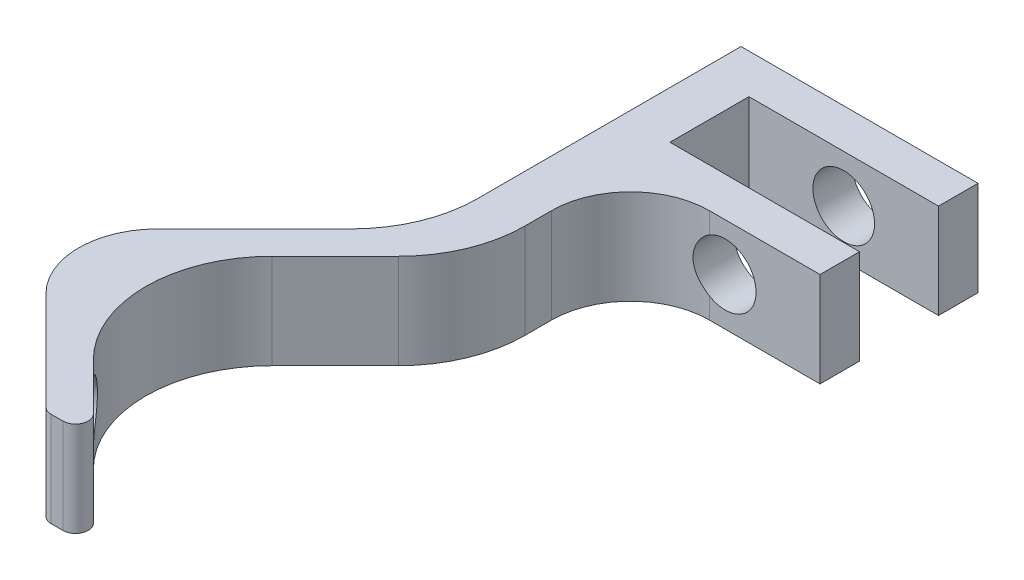
ISO-10303-21;
HEADER;
FILE_DESCRIPTION(('STEP AP214'),'2;1');
FILE_NAME('part.step','',(''),(''),'','','');
FILE_SCHEMA(('AUTOMOTIVE_DESIGN { 1 0 10303 214 1 1 1 1 }'));
ENDSEC;
DATA;
#1=APPLICATION_CONTEXT('core data for automotive mechanical design processes');
#2=APPLICATION_PROTOCOL_DEFINITION('international standard','automotive_design',2000,#1);
#3=PRODUCT_CONTEXT('',#1,'mechanical');
#4=PRODUCT('Part','Part','',(#3));
#5=PRODUCT_RELATED_PRODUCT_CATEGORY('part','',(#4));
#6=PRODUCT_DEFINITION_FORMATION('','',#4);
#7=PRODUCT_DEFINITION_CONTEXT('part definition',#1,'design');
#8=PRODUCT_DEFINITION('design','',#6,#7);
#9=PRODUCT_DEFINITION_SHAPE('','',#8);
#10=(LENGTH_UNIT() NAMED_UNIT(*) SI_UNIT(.MILLI.,.METRE.));
#11=(NAMED_UNIT(*) PLANE_ANGLE_UNIT() SI_UNIT($,.RADIAN.));
#12=(NAMED_UNIT(*) SI_UNIT($,.STERADIAN.) SOLID_ANGLE_UNIT());
#13=UNCERTAINTY_MEASURE_WITH_UNIT(LENGTH_MEASURE(1.E-05),#10,'distance_accuracy_value','');
#14=(GEOMETRIC_REPRESENTATION_CONTEXT(3) GLOBAL_UNCERTAINTY_ASSIGNED_CONTEXT((#13)) GLOBAL_UNIT_ASSIGNED_CONTEXT((#10,
#11,#12)) REPRESENTATION_CONTEXT('',''));
#15=CARTESIAN_POINT('',(0.,0.,0.));
#16=DIRECTION('',(0.,0.,1.));
#17=DIRECTION('',(1.,0.,0.));
#18=AXIS2_PLACEMENT_3D('',#15,#16,#17);
#19=CARTESIAN_POINT('',(2.31370849898492,6.,11.9999999999999));
#20=DIRECTION('',(0.,1.,0.));
#21=DIRECTION('',(0.,0.,1.));
#22=AXIS2_PLACEMENT_3D('',#19,#20,#21);
#23=CYLINDRICAL_SURFACE('',#22,8.);
#24=CARTESIAN_POINT('',(-3.34314575050741,1.11172612947398,17.6568542494924));
#25=CARTESIAN_POINT('',(-3.38026868633156,1.11758526246244,17.6197352850169));
#26=CARTESIAN_POINT('',(-3.41683027289528,1.12563296642928,17.5824381308588));
#27=CARTESIAN_POINT('',(-3.48863525563479,1.1460382770672,17.507765682977));
#28=CARTESIAN_POINT('',(-3.52387886168609,1.15839519427455,17.4703904027037));
#29=CARTESIAN_POINT('',(-3.62718020571579,1.2017585388184,17.3587378902489));
#30=CARTESIAN_POINT('',(-3.69300080004003,1.23908834308023,17.2847408116208));
#31=CARTESIAN_POINT('',(-3.8171330718599,1.32945350983912,17.1402224438868));
#32=CARTESIAN_POINT('',(-3.87544506117879,1.38248821982848,17.0697010105168));
#33=CARTESIAN_POINT('',(-3.98370965686038,1.50276665976273,16.9345744177806));
#34=CARTESIAN_POINT('',(-4.03366074129167,1.57001297160887,16.8699703365141));
#35=CARTESIAN_POINT('',(-4.12531984934452,1.71805560649986,16.7481395890465));
#36=CARTESIAN_POINT('',(-4.16688623946183,1.79904797842029,16.6910445814565));
#37=CARTESIAN_POINT('',(-4.24042213781519,1.97165862140514,16.5877449082642));
#38=CARTESIAN_POINT('',(-4.27239058310512,2.06327806783246,16.5415414489927));
#39=CARTESIAN_POINT('',(-4.32666619054601,2.25523302013596,16.4618130253665));
#40=CARTESIAN_POINT('',(-4.34891563127374,2.35561646243348,16.4283639548239));
#41=CARTESIAN_POINT('',(-4.38333734596562,2.56177592608797,16.3761359280304));
#42=CARTESIAN_POINT('',(-4.39551151144071,2.66755093128403,16.3573542181974));
#43=CARTESIAN_POINT('',(-4.40958235520566,2.8793772401308,16.3356114356775));
#44=CARTESIAN_POINT('',(-4.41166685351984,2.98538643669897,16.3323612569368));
#45=CARTESIAN_POINT('',(-4.40605536689188,3.19651347740194,16.3410597195594));
#46=CARTESIAN_POINT('',(-4.39835991880231,3.3016313701444,16.3530075266566));
#47=CARTESIAN_POINT('',(-4.37337216450155,3.50682541552482,16.3912937117799));
#48=CARTESIAN_POINT('',(-4.35618473358038,3.60694385201099,16.4174747804725));
#49=CARTESIAN_POINT('',(-4.31238360338175,3.80063489942152,16.4829057726309));
#50=CARTESIAN_POINT('',(-4.28576878666177,3.89420673279176,16.5221572453186));
#51=CARTESIAN_POINT('',(-4.22278762552673,4.07373662366312,16.6127320785239));
#52=CARTESIAN_POINT('',(-4.18627663084817,4.15955430973277,16.6642329964151));
#53=CARTESIAN_POINT('',(-4.10396524697651,4.31966549521458,16.7768521724449));
#54=CARTESIAN_POINT('',(-4.05816355477987,4.39395737557119,16.8379717793174));
#55=CARTESIAN_POINT('',(-3.9569262236325,4.5301046326261,16.9685068854595));
#56=CARTESIAN_POINT('',(-3.90134813873787,4.5917419557098,17.0380394941433));
#57=CARTESIAN_POINT('',(-3.78187485749184,4.69924455389021,17.1819479334774));
#58=CARTESIAN_POINT('',(-3.7179848770027,4.74511965487436,17.2563207123291));
#59=CARTESIAN_POINT('',(-3.60250627958484,4.80899428700221,17.3854993437981));
#60=CARTESIAN_POINT('',(-3.55264356938268,4.83121502751205,17.4398007323498));
#61=CARTESIAN_POINT('',(-3.4499670508317,4.86659987206433,17.548486555556));
#62=CARTESIAN_POINT('',(-3.39715529998864,4.8797702071596,17.602870907186));
#63=CARTESIAN_POINT('',(-3.34314575050741,4.88827387052602,17.6568542494924));
#64=B_SPLINE_CURVE_WITH_KNOTS('',3,(#24,#25,#26,#27,#28,#29,#30,#31,#32,#33,#34,#35,#36,#37,#38,
#39,#40,#41,#42,#43,#44,#45,#46,#47,#48,#49,#50,#51,#52,#53,#54,#55,#56,#57,#58,#59,#60,#61,#62,
#63),.UNSPECIFIED.,.F.,.F.,(4,2,2,2,2,2,2,2,2,2,2,2,2,2,2,2,2,2,2,4),(0.,0.158368251928382,
0.316711176934528,0.632584748658386,0.948445198302263,1.26436308148817,1.58523781663443,
1.90614807468226,2.22893913929065,2.55166959002935,2.86836865480728,3.18505033571081,
3.49830109793384,3.81158900268269,4.12972921281349,4.44791407242166,4.77119098163774,
5.09426599861504,5.32470014190911,5.55497547576771),.UNSPECIFIED.);
#65=CARTESIAN_POINT('',(-3.34314575050741,1.11172612947398,17.6568542494924));
#66=VERTEX_POINT('',#65);
#67=CARTESIAN_POINT('',(-3.34314575050741,4.88827387052602,17.6568542494924));
#68=VERTEX_POINT('',#67);
#69=EDGE_CURVE('E212',#66,#68,#64,.T.);
#70=ORIENTED_EDGE('',*,*,#69,.F.);
#71=DIRECTION('',(0.,-1.,0.));
#72=VECTOR('',#71,1.);
#73=CARTESIAN_POINT('',(-3.34314575050741,6.,17.6568542494924));
#74=LINE('',#73,#72);
#75=CARTESIAN_POINT('',(-3.34314575050741,0.,17.6568542494924));
#76=VERTEX_POINT('',#75);
#77=EDGE_CURVE('E319',#76,#66,#74,.F.);
#78=ORIENTED_EDGE('',*,*,#77,.F.);
#79=CARTESIAN_POINT('',(2.31370849898492,0.,11.9999999999999));
#80=DIRECTION('',(0.,1.,0.));
#81=DIRECTION('',(0.,0.,1.));
#82=AXIS2_PLACEMENT_3D('',#79,#80,#81);
#83=CIRCLE('',#82,8.);
#84=CARTESIAN_POINT('',(-3.34314575050749,0.,6.34314575050757));
#85=VERTEX_POINT('',#84);
#86=EDGE_CURVE('E322',#85,#76,#83,.T.);
#87=ORIENTED_EDGE('',*,*,#86,.F.);
#88=DIRECTION('',(0.,-1.,0.));
#89=VECTOR('',#88,1.);
#90=CARTESIAN_POINT('',(-3.34314575050749,0.,6.34314575050757));
#91=LINE('',#90,#89);
#92=CARTESIAN_POINT('',(-3.34314575050749,6.,6.34314575050757));
#93=VERTEX_POINT('',#92);
#94=EDGE_CURVE('E315',#93,#85,#91,.T.);
#95=ORIENTED_EDGE('',*,*,#94,.F.);
#96=CARTESIAN_POINT('',(2.31370849898492,6.,11.9999999999999));
#97=DIRECTION('',(0.,1.,0.));
#98=DIRECTION('',(0.,0.,1.));
#99=AXIS2_PLACEMENT_3D('',#96,#97,#98);
#100=CIRCLE('',#99,8.);
#101=CARTESIAN_POINT('',(-3.34314575050741,6.,17.6568542494924));
#102=VERTEX_POINT('',#101);
#103=EDGE_CURVE('E325',#102,#93,#100,.F.);
#104=ORIENTED_EDGE('',*,*,#103,.F.);
#105=EDGE_CURVE('E318',#68,#102,#74,.F.);
#106=ORIENTED_EDGE('',*,*,#105,.F.);
#107=EDGE_LOOP('',(#70,#78,#87,#95,#104,#106));
#108=FACE_BOUND('',#107,.T.);
#109=ADVANCED_FACE('F39',(#108),#23,.F.);
#110=CARTESIAN_POINT('',(0.,6.,0.));
#111=DIRECTION('',(0.707106781186551,0.,0.707106781186544));
#112=DIRECTION('',(0.707106781186544,0.,-0.707106781186551));
#113=AXIS2_PLACEMENT_3D('',#110,#111,#112);
#114=PLANE('',#113);
#115=DIRECTION('',(-0.707106781186544,0.,0.707106781186551));
#116=VECTOR('',#115,1.);
#117=CARTESIAN_POINT('',(0.,6.,0.));
#118=LINE('',#117,#116);
#119=CARTESIAN_POINT('',(-2.34314575050759,6.,2.34314575050762));
#120=VERTEX_POINT('',#119);
#121=CARTESIAN_POINT('',(-8.46446609406714,6.,8.46446609406723));
#122=VERTEX_POINT('',#121);
#123=EDGE_CURVE('E301',#120,#122,#118,.T.);
#124=ORIENTED_EDGE('',*,*,#123,.F.);
#125=DIRECTION('',(0.,-1.,0.));
#126=VECTOR('',#125,1.);
#127=CARTESIAN_POINT('',(-2.34314575050759,6.,2.34314575050762));
#128=LINE('',#127,#126);
#129=CARTESIAN_POINT('',(-2.34314575050759,0.,2.34314575050762));
#130=VERTEX_POINT('',#129);
#131=EDGE_CURVE('E338',#120,#130,#128,.T.);
#132=ORIENTED_EDGE('',*,*,#131,.T.);
#133=DIRECTION('',(-0.707106781186544,0.,0.707106781186551));
#134=VECTOR('',#133,1.);
#135=CARTESIAN_POINT('',(0.,0.,0.));
#136=LINE('',#135,#134);
#137=CARTESIAN_POINT('',(-8.46446609406714,0.,8.46446609406723));
#138=VERTEX_POINT('',#137);
#139=EDGE_CURVE('E263',#130,#138,#136,.T.);
#140=ORIENTED_EDGE('',*,*,#139,.T.);
#141=DIRECTION('',(0.,-1.,0.));
#142=VECTOR('',#141,1.);
#143=CARTESIAN_POINT('',(-8.46446609406714,6.,8.46446609406723));
#144=LINE('',#143,#142);
#145=EDGE_CURVE('E333',#138,#122,#144,.F.);
#146=ORIENTED_EDGE('',*,*,#145,.T.);
#147=EDGE_LOOP('',(#124,#132,#140,#146));
#148=FACE_BOUND('',#147,.T.);
#149=ADVANCED_FACE('F441',(#148),#114,.F.);
#150=CARTESIAN_POINT('',(-11.9999999999998,6.,12.));
#151=DIRECTION('',(0.707106781186541,0.,-0.707106781186554));
#152=DIRECTION('',(-0.707106781186554,0.,-0.707106781186541));
#153=AXIS2_PLACEMENT_3D('',#150,#151,#152);
#154=PLANE('',#153);
#155=CARTESIAN_POINT('',(-4.69411254969515,3.,19.3058874503046));
#156=DIRECTION('',(0.707106781186541,0.,-0.707106781186554));
#157=DIRECTION('',(-0.707106781186554,0.,-0.707106781186541));
#158=AXIS2_PLACEMENT_3D('',#155,#156,#157);
#159=CIRCLE('',#158,1.9);
#160=CARTESIAN_POINT('',(-6.0376154339496,3.,17.9623845660502));
#161=VERTEX_POINT('',#160);
#162=EDGE_CURVE('E266',#161,#161,#159,.F.);
#163=ORIENTED_EDGE('',*,*,#162,.F.);
#164=EDGE_LOOP('',(#163));
#165=FACE_BOUND('',#164,.T.);
#166=DIRECTION('',(0.707106781186554,0.,0.707106781186541));
#167=VECTOR('',#166,1.);
#168=CARTESIAN_POINT('',(-11.9999999999998,0.,12.));
#169=LINE('',#168,#167);
#170=CARTESIAN_POINT('',(-8.46446609406709,0.,15.5355339059327));
#171=VERTEX_POINT('',#170);
#172=CARTESIAN_POINT('',(-2.23431457505044,0.,21.7656854249492));
#173=VERTEX_POINT('',#172);
#174=EDGE_CURVE('E265',#171,#173,#169,.T.);
#175=ORIENTED_EDGE('',*,*,#174,.T.);
#176=DIRECTION('',(0.,-1.,0.));
#177=VECTOR('',#176,1.);
#178=CARTESIAN_POINT('',(-2.23431457505045,6.,21.7656854249492));
#179=LINE('',#178,#177);
#180=CARTESIAN_POINT('',(-2.23431457505044,6.,21.7656854249492));
#181=VERTEX_POINT('',#180);
#182=EDGE_CURVE('E365',#173,#181,#179,.F.);
#183=ORIENTED_EDGE('',*,*,#182,.T.);
#184=DIRECTION('',(0.707106781186554,0.,0.707106781186541));
#185=VECTOR('',#184,1.);
#186=CARTESIAN_POINT('',(-11.9999999999998,6.,12.));
#187=LINE('',#186,#185);
#188=CARTESIAN_POINT('',(-8.46446609406709,6.,15.5355339059327));
#189=VERTEX_POINT('',#188);
#190=EDGE_CURVE('E405',#189,#181,#187,.T.);
#191=ORIENTED_EDGE('',*,*,#190,.F.);
#192=DIRECTION('',(0.,-1.,0.));
#193=VECTOR('',#192,1.);
#194=CARTESIAN_POINT('',(-8.46446609406709,6.,15.5355339059327));
#195=LINE('',#194,#193);
#196=EDGE_CURVE('E327',#189,#171,#195,.T.);
#197=ORIENTED_EDGE('',*,*,#196,.T.);
#198=EDGE_LOOP('',(#175,#183,#191,#197));
#199=FACE_BOUND('',#198,.T.);
#200=ADVANCED_FACE('F451',(#165,#199),#154,.F.);
#201=CARTESIAN_POINT('',(0.,6.,22.));
#202=DIRECTION('',(0.,0.,-1.));
#203=DIRECTION('',(-1.,0.,0.));
#204=AXIS2_PLACEMENT_3D('',#201,#202,#203);
#205=PLANE('',#204);
#206=DIRECTION('',(1.,0.,0.));
#207=VECTOR('',#206,1.);
#208=CARTESIAN_POINT('',(0.,6.,22.));
#209=LINE('',#208,#207);
#210=CARTESIAN_POINT('',(-1.66862915010121,6.,22.));
#211=VERTEX_POINT('',#210);
#212=CARTESIAN_POINT('',(-0.93137084989818,6.,22.));
#213=VERTEX_POINT('',#212);
#214=EDGE_CURVE('E400',#211,#213,#209,.T.);
#215=ORIENTED_EDGE('',*,*,#214,.F.);
#216=DIRECTION('',(0.,-1.,0.));
#217=VECTOR('',#216,1.);
#218=CARTESIAN_POINT('',(-1.66862915010121,6.,22.));
#219=LINE('',#218,#217);
#220=CARTESIAN_POINT('',(-1.66862915010121,0.,22.));
#221=VERTEX_POINT('',#220);
#222=EDGE_CURVE('E358',#211,#221,#219,.T.);
#223=ORIENTED_EDGE('',*,*,#222,.T.);
#224=DIRECTION('',(1.,0.,0.));
#225=VECTOR('',#224,1.);
#226=CARTESIAN_POINT('',(0.,0.,22.));
#227=LINE('',#226,#225);
#228=CARTESIAN_POINT('',(-0.93137084989818,0.,22.));
#229=VERTEX_POINT('',#228);
#230=EDGE_CURVE('E269',#221,#229,#227,.T.);
#231=ORIENTED_EDGE('',*,*,#230,.T.);
#232=DIRECTION('',(0.,-1.,0.));
#233=VECTOR('',#232,1.);
#234=CARTESIAN_POINT('',(-0.93137084989818,6.,22.));
#235=LINE('',#234,#233);
#236=EDGE_CURVE('E356',#229,#213,#235,.F.);
#237=ORIENTED_EDGE('',*,*,#236,.T.);
#238=EDGE_LOOP('',(#215,#223,#231,#237));
#239=FACE_BOUND('',#238,.T.);
#240=ADVANCED_FACE('F458',(#239),#205,.F.);
#241=CARTESIAN_POINT('',(-10.4999999999998,6.,10.5));
#242=DIRECTION('',(-0.707106781186541,0.,0.707106781186554));
#243=DIRECTION('',(0.707106781186554,0.,0.707106781186541));
#244=AXIS2_PLACEMENT_3D('',#241,#242,#243);
#245=PLANE('',#244);
#246=CARTESIAN_POINT('',(-3.19411254969517,3.,17.8058874503046));
#247=DIRECTION('',(-0.707106781186541,0.,0.707106781186554));
#248=DIRECTION('',(0.707106781186554,0.,0.707106781186541));
#249=AXIS2_PLACEMENT_3D('',#246,#247,#248);
#250=CIRCLE('',#249,1.9);
#251=EDGE_CURVE('E389',#68,#66,#250,.F.);
#252=ORIENTED_EDGE('',*,*,#251,.F.);
#253=ORIENTED_EDGE('',*,*,#105,.T.);
#254=DIRECTION('',(-0.707106781186554,0.,-0.707106781186541));
#255=VECTOR('',#254,1.);
#256=CARTESIAN_POINT('',(-10.4999999999998,6.,10.5));
#257=LINE('',#256,#255);
#258=CARTESIAN_POINT('',(-0.365685424948947,6.,20.6343145750508));
#259=VERTEX_POINT('',#258);
#260=EDGE_CURVE('E378',#259,#102,#257,.T.);
#261=ORIENTED_EDGE('',*,*,#260,.F.);
#262=DIRECTION('',(0.,-1.,0.));
#263=VECTOR('',#262,1.);
#264=CARTESIAN_POINT('',(-0.365685424948947,6.,20.6343145750508));
#265=LINE('',#264,#263);
#266=CARTESIAN_POINT('',(-0.365685424948947,0.,20.6343145750508));
#267=VERTEX_POINT('',#266);
#268=EDGE_CURVE('E215',#259,#267,#265,.T.);
#269=ORIENTED_EDGE('',*,*,#268,.T.);
#270=DIRECTION('',(-0.707106781186554,0.,-0.707106781186541));
#271=VECTOR('',#270,1.);
#272=CARTESIAN_POINT('',(-10.4999999999998,0.,10.5));
#273=LINE('',#272,#271);
#274=EDGE_CURVE('E272',#267,#76,#273,.T.);
#275=ORIENTED_EDGE('',*,*,#274,.T.);
#276=ORIENTED_EDGE('',*,*,#77,.T.);
#277=EDGE_LOOP('',(#252,#253,#261,#269,#275,#276));
#278=FACE_BOUND('',#277,.T.);
#279=ADVANCED_FACE('F376',(#278),#245,.F.);
#280=CARTESIAN_POINT('',(1.50000000000002,6.,1.5));
#281=DIRECTION('',(-0.707106781186551,0.,-0.707106781186544));
#282=DIRECTION('',(-0.707106781186544,0.,0.707106781186551));
#283=AXIS2_PLACEMENT_3D('',#280,#281,#282);
#284=PLANE('',#283);
#285=DIRECTION('',(0.707106781186544,0.,-0.707106781186551));
#286=VECTOR('',#285,1.);
#287=CARTESIAN_POINT('',(1.50000000000002,0.,1.5));
#288=LINE('',#287,#286);
#289=CARTESIAN_POINT('',(0.656854249492411,0.,2.34314575050762));
#290=VERTEX_POINT('',#289);
#291=EDGE_CURVE('E274',#85,#290,#288,.T.);
#292=ORIENTED_EDGE('',*,*,#291,.T.);
#293=DIRECTION('',(0.,-1.,0.));
#294=VECTOR('',#293,1.);
#295=CARTESIAN_POINT('',(0.656854249492411,6.,2.34314575050762));
#296=LINE('',#295,#294);
#297=CARTESIAN_POINT('',(0.656854249492411,6.,2.34314575050762));
#298=VERTEX_POINT('',#297);
#299=EDGE_CURVE('E348',#290,#298,#296,.F.);
#300=ORIENTED_EDGE('',*,*,#299,.T.);
#301=DIRECTION('',(0.707106781186544,0.,-0.707106781186551));
#302=VECTOR('',#301,1.);
#303=CARTESIAN_POINT('',(1.50000000000002,6.,1.5));
#304=LINE('',#303,#302);
#305=EDGE_CURVE('E242',#93,#298,#304,.T.);
#306=ORIENTED_EDGE('',*,*,#305,.F.);
#307=ORIENTED_EDGE('',*,*,#94,.T.);
#308=EDGE_LOOP('',(#292,#300,#306,#307));
#309=FACE_BOUND('',#308,.T.);
#310=ADVANCED_FACE('F398',(#309),#284,.F.);
#311=CARTESIAN_POINT('',(3.,6.,0.));
#312=DIRECTION('',(1.,0.,0.));
#313=DIRECTION('',(0.,0.,-1.));
#314=AXIS2_PLACEMENT_3D('',#311,#312,#313);
#315=PLANE('',#314);
#316=DIRECTION('',(0.,0.,1.));
#317=VECTOR('',#316,1.);
#318=CARTESIAN_POINT('',(3.,0.,0.));
#319=LINE('',#318,#317);
#320=CARTESIAN_POINT('',(3.,0.,-5.));
#321=VERTEX_POINT('',#320);
#322=CARTESIAN_POINT('',(3.,0.,-3.31370849898473));
#323=VERTEX_POINT('',#322);
#324=EDGE_CURVE('E277',#321,#323,#319,.T.);
#325=ORIENTED_EDGE('',*,*,#324,.F.);
#326=DIRECTION('',(0.,-1.,0.));
#327=VECTOR('',#326,1.);
#328=CARTESIAN_POINT('',(3.,6.,-5.));
#329=LINE('',#328,#327);
#330=CARTESIAN_POINT('',(3.,6.,-5.));
#331=VERTEX_POINT('',#330);
#332=EDGE_CURVE('E214',#321,#331,#329,.F.);
#333=ORIENTED_EDGE('',*,*,#332,.T.);
#334=DIRECTION('',(0.,0.,1.));
#335=VECTOR('',#334,1.);
#336=CARTESIAN_POINT('',(3.,6.,0.));
#337=LINE('',#336,#335);
#338=CARTESIAN_POINT('',(3.,6.,-3.31370849898473));
#339=VERTEX_POINT('',#338);
#340=EDGE_CURVE('E236',#331,#339,#337,.T.);
#341=ORIENTED_EDGE('',*,*,#340,.T.);
#342=DIRECTION('',(0.,-1.,0.));
#343=VECTOR('',#342,1.);
#344=CARTESIAN_POINT('',(3.,0.,-3.31370849898473));
#345=LINE('',#344,#343);
#346=EDGE_CURVE('E343',#339,#323,#345,.T.);
#347=ORIENTED_EDGE('',*,*,#346,.T.);
#348=EDGE_LOOP('',(#325,#333,#341,#347));
#349=FACE_BOUND('',#348,.T.);
#350=ADVANCED_FACE('F488',(#349),#315,.T.);
#351=CARTESIAN_POINT('',(0.,6.,-10.));
#352=DIRECTION('',(0.,0.,1.));
#353=DIRECTION('',(1.,0.,0.));
#354=AXIS2_PLACEMENT_3D('',#351,#352,#353);
#355=PLANE('',#354);
#356=CARTESIAN_POINT('',(9.,3.,-10.));
#357=DIRECTION('',(0.,0.,1.));
#358=DIRECTION('',(1.,0.,0.));
#359=AXIS2_PLACEMENT_3D('',#356,#357,#358);
#360=CIRCLE('',#359,1.95);
#361=CARTESIAN_POINT('',(8.,1.32593309572168,-10.));
#362=VERTEX_POINT('',#361);
#363=CARTESIAN_POINT('',(8.,4.67406690427832,-10.));
#364=VERTEX_POINT('',#363);
#365=EDGE_CURVE('E59',#362,#364,#360,.T.);
#366=ORIENTED_EDGE('',*,*,#365,.F.);
#367=DIRECTION('',(0.,-1.,0.));
#368=VECTOR('',#367,1.);
#369=CARTESIAN_POINT('',(8.,0.,-10.));
#370=LINE('',#369,#368);
#371=CARTESIAN_POINT('',(8.,0.,-10.));
#372=VERTEX_POINT('',#371);
#373=EDGE_CURVE('E205',#362,#372,#370,.T.);
#374=ORIENTED_EDGE('',*,*,#373,.T.);
#375=DIRECTION('',(-1.,0.,0.));
#376=VECTOR('',#375,1.);
#377=CARTESIAN_POINT('',(0.,0.,-10.));
#378=LINE('',#377,#376);
#379=CARTESIAN_POINT('',(15.,0.,-10.));
#380=VERTEX_POINT('',#379);
#381=EDGE_CURVE('E279',#380,#372,#378,.T.);
#382=ORIENTED_EDGE('',*,*,#381,.F.);
#383=DIRECTION('',(0.,-1.,0.));
#384=VECTOR('',#383,1.);
#385=CARTESIAN_POINT('',(15.,6.,-10.));
#386=LINE('',#385,#384);
#387=CARTESIAN_POINT('',(15.,6.,-10.));
#388=VERTEX_POINT('',#387);
#389=EDGE_CURVE('E237',#388,#380,#386,.T.);
#390=ORIENTED_EDGE('',*,*,#389,.F.);
#391=DIRECTION('',(-1.,0.,0.));
#392=VECTOR('',#391,1.);
#393=CARTESIAN_POINT('',(0.,6.,-10.));
#394=LINE('',#393,#392);
#395=CARTESIAN_POINT('',(8.,6.,-10.));
#396=VERTEX_POINT('',#395);
#397=EDGE_CURVE('E233',#388,#396,#394,.T.);
#398=ORIENTED_EDGE('',*,*,#397,.T.);
#399=EDGE_CURVE('E207',#396,#364,#370,.T.);
#400=ORIENTED_EDGE('',*,*,#399,.T.);
#401=EDGE_LOOP('',(#366,#374,#382,#390,#398,#400));
#402=FACE_BOUND('',#401,.T.);
#403=ADVANCED_FACE('F203',(#402),#355,.T.);
#404=CARTESIAN_POINT('',(15.,6.,0.));
#405=DIRECTION('',(1.,0.,0.));
#406=DIRECTION('',(0.,0.,-1.));
#407=AXIS2_PLACEMENT_3D('',#404,#405,#406);
#408=PLANE('',#407);
#409=DIRECTION('',(0.,0.,1.));
#410=VECTOR('',#409,1.);
#411=CARTESIAN_POINT('',(15.,0.,0.));
#412=LINE('',#411,#410);
#413=CARTESIAN_POINT('',(15.,0.,-12.5));
#414=VERTEX_POINT('',#413);
#415=EDGE_CURVE('E281',#414,#380,#412,.T.);
#416=ORIENTED_EDGE('',*,*,#415,.F.);
#417=DIRECTION('',(0.,-1.,0.));
#418=VECTOR('',#417,1.);
#419=CARTESIAN_POINT('',(15.,6.,-12.5));
#420=LINE('',#419,#418);
#421=CARTESIAN_POINT('',(15.,6.,-12.5));
#422=VERTEX_POINT('',#421);
#423=EDGE_CURVE('E312',#422,#414,#420,.T.);
#424=ORIENTED_EDGE('',*,*,#423,.F.);
#425=DIRECTION('',(0.,0.,1.));
#426=VECTOR('',#425,1.);
#427=CARTESIAN_POINT('',(15.,6.,0.));
#428=LINE('',#427,#426);
#429=EDGE_CURVE('E238',#422,#388,#428,.T.);
#430=ORIENTED_EDGE('',*,*,#429,.T.);
#431=ORIENTED_EDGE('',*,*,#389,.T.);
#432=EDGE_LOOP('',(#416,#424,#430,#431));
#433=FACE_BOUND('',#432,.T.);
#434=ADVANCED_FACE('F495',(#433),#408,.T.);
#435=CARTESIAN_POINT('',(0.,6.,-12.5));
#436=DIRECTION('',(0.,0.,-1.));
#437=DIRECTION('',(-1.,0.,0.));
#438=AXIS2_PLACEMENT_3D('',#435,#436,#437);
#439=PLANE('',#438);
#440=CARTESIAN_POINT('',(9.,3.,-12.5));
#441=DIRECTION('',(0.,0.,-1.));
#442=DIRECTION('',(-1.,0.,0.));
#443=AXIS2_PLACEMENT_3D('',#440,#441,#442);
#444=CIRCLE('',#443,1.95);
#445=CARTESIAN_POINT('',(7.05,3.,-12.5));
#446=VERTEX_POINT('',#445);
#447=EDGE_CURVE('E391',#446,#446,#444,.T.);
#448=ORIENTED_EDGE('',*,*,#447,.F.);
#449=EDGE_LOOP('',(#448));
#450=FACE_BOUND('',#449,.T.);
#451=DIRECTION('',(1.,0.,0.));
#452=VECTOR('',#451,1.);
#453=CARTESIAN_POINT('',(0.,0.,-12.5));
#454=LINE('',#453,#452);
#455=CARTESIAN_POINT('',(3.,0.,-12.5));
#456=VERTEX_POINT('',#455);
#457=EDGE_CURVE('E284',#456,#414,#454,.T.);
#458=ORIENTED_EDGE('',*,*,#457,.F.);
#459=DIRECTION('',(0.,-1.,0.));
#460=VECTOR('',#459,1.);
#461=CARTESIAN_POINT('',(3.,6.,-12.5));
#462=LINE('',#461,#460);
#463=CARTESIAN_POINT('',(3.,6.,-12.5));
#464=VERTEX_POINT('',#463);
#465=EDGE_CURVE('E310',#464,#456,#462,.T.);
#466=ORIENTED_EDGE('',*,*,#465,.F.);
#467=DIRECTION('',(1.,0.,0.));
#468=VECTOR('',#467,1.);
#469=CARTESIAN_POINT('',(0.,6.,-12.5));
#470=LINE('',#469,#468);
#471=EDGE_CURVE('E240',#464,#422,#470,.T.);
#472=ORIENTED_EDGE('',*,*,#471,.T.);
#473=ORIENTED_EDGE('',*,*,#423,.T.);
#474=EDGE_LOOP('',(#458,#466,#472,#473));
#475=FACE_BOUND('',#474,.T.);
#476=ADVANCED_FACE('F630',(#450,#475),#439,.T.);
#477=CARTESIAN_POINT('',(3.,6.,0.));
#478=DIRECTION('',(1.,0.,0.));
#479=DIRECTION('',(0.,0.,-1.));
#480=AXIS2_PLACEMENT_3D('',#477,#478,#479);
#481=PLANE('',#480);
#482=DIRECTION('',(0.,0.,1.));
#483=VECTOR('',#482,1.);
#484=CARTESIAN_POINT('',(3.,0.,0.));
#485=LINE('',#484,#483);
#486=CARTESIAN_POINT('',(3.,0.,-17.5));
#487=VERTEX_POINT('',#486);
#488=EDGE_CURVE('E287',#487,#456,#485,.T.);
#489=ORIENTED_EDGE('',*,*,#488,.F.);
#490=DIRECTION('',(0.,-1.,0.));
#491=VECTOR('',#490,1.);
#492=CARTESIAN_POINT('',(3.,6.,-17.5));
#493=LINE('',#492,#491);
#494=CARTESIAN_POINT('',(3.,6.,-17.5));
#495=VERTEX_POINT('',#494);
#496=EDGE_CURVE('E308',#495,#487,#493,.T.);
#497=ORIENTED_EDGE('',*,*,#496,.F.);
#498=DIRECTION('',(0.,0.,1.));
#499=VECTOR('',#498,1.);
#500=CARTESIAN_POINT('',(3.,6.,0.));
#501=LINE('',#500,#499);
#502=EDGE_CURVE('E248',#495,#464,#501,.T.);
#503=ORIENTED_EDGE('',*,*,#502,.T.);
#504=ORIENTED_EDGE('',*,*,#465,.T.);
#505=EDGE_LOOP('',(#489,#497,#503,#504));
#506=FACE_BOUND('',#505,.T.);
#507=ADVANCED_FACE('F626',(#506),#481,.T.);
#508=CARTESIAN_POINT('',(0.,6.,-17.5));
#509=DIRECTION('',(0.,0.,1.));
#510=DIRECTION('',(1.,0.,0.));
#511=AXIS2_PLACEMENT_3D('',#508,#509,#510);
#512=PLANE('',#511);
#513=CARTESIAN_POINT('',(9.,3.,-17.5));
#514=DIRECTION('',(0.,0.,1.));
#515=DIRECTION('',(1.,0.,0.));
#516=AXIS2_PLACEMENT_3D('',#513,#514,#515);
#517=CIRCLE('',#516,1.95);
#518=CARTESIAN_POINT('',(10.95,3.,-17.5));
#519=VERTEX_POINT('',#518);
#520=EDGE_CURVE('E208',#519,#519,#517,.T.);
#521=ORIENTED_EDGE('',*,*,#520,.F.);
#522=EDGE_LOOP('',(#521));
#523=FACE_BOUND('',#522,.T.);
#524=DIRECTION('',(-1.,0.,0.));
#525=VECTOR('',#524,1.);
#526=CARTESIAN_POINT('',(0.,0.,-17.5));
#527=LINE('',#526,#525);
#528=CARTESIAN_POINT('',(15.,0.,-17.5));
#529=VERTEX_POINT('',#528);
#530=EDGE_CURVE('E290',#529,#487,#527,.T.);
#531=ORIENTED_EDGE('',*,*,#530,.F.);
#532=DIRECTION('',(0.,-1.,0.));
#533=VECTOR('',#532,1.);
#534=CARTESIAN_POINT('',(15.,6.,-17.5));
#535=LINE('',#534,#533);
#536=CARTESIAN_POINT('',(15.,6.,-17.5));
#537=VERTEX_POINT('',#536);
#538=EDGE_CURVE('E306',#537,#529,#535,.T.);
#539=ORIENTED_EDGE('',*,*,#538,.F.);
#540=DIRECTION('',(-1.,0.,0.));
#541=VECTOR('',#540,1.);
#542=CARTESIAN_POINT('',(0.,6.,-17.5));
#543=LINE('',#542,#541);
#544=EDGE_CURVE('E251',#537,#495,#543,.T.);
#545=ORIENTED_EDGE('',*,*,#544,.T.);
#546=ORIENTED_EDGE('',*,*,#496,.T.);
#547=EDGE_LOOP('',(#531,#539,#545,#546));
#548=FACE_BOUND('',#547,.T.);
#549=ADVANCED_FACE('F622',(#523,#548),#512,.T.);
#550=CARTESIAN_POINT('',(15.,6.,0.));
#551=DIRECTION('',(1.,0.,0.));
#552=DIRECTION('',(0.,0.,-1.));
#553=AXIS2_PLACEMENT_3D('',#550,#551,#552);
#554=PLANE('',#553);
#555=DIRECTION('',(0.,0.,1.));
#556=VECTOR('',#555,1.);
#557=CARTESIAN_POINT('',(15.,0.,0.));
#558=LINE('',#557,#556);
#559=CARTESIAN_POINT('',(15.,0.,-20.));
#560=VERTEX_POINT('',#559);
#561=EDGE_CURVE('E293',#560,#529,#558,.T.);
#562=ORIENTED_EDGE('',*,*,#561,.F.);
#563=DIRECTION('',(0.,-1.,0.));
#564=VECTOR('',#563,1.);
#565=CARTESIAN_POINT('',(15.,6.,-20.));
#566=LINE('',#565,#564);
#567=CARTESIAN_POINT('',(15.,6.,-20.));
#568=VERTEX_POINT('',#567);
#569=EDGE_CURVE('E304',#568,#560,#566,.T.);
#570=ORIENTED_EDGE('',*,*,#569,.F.);
#571=DIRECTION('',(0.,0.,1.));
#572=VECTOR('',#571,1.);
#573=CARTESIAN_POINT('',(15.,6.,0.));
#574=LINE('',#573,#572);
#575=EDGE_CURVE('E254',#568,#537,#574,.T.);
#576=ORIENTED_EDGE('',*,*,#575,.T.);
#577=ORIENTED_EDGE('',*,*,#538,.T.);
#578=EDGE_LOOP('',(#562,#570,#576,#577));
#579=FACE_BOUND('',#578,.T.);
#580=ADVANCED_FACE('F423',(#579),#554,.T.);
#581=CARTESIAN_POINT('',(0.,6.,-20.));
#582=DIRECTION('',(0.,0.,-1.));
#583=DIRECTION('',(-1.,0.,0.));
#584=AXIS2_PLACEMENT_3D('',#581,#582,#583);
#585=PLANE('',#584);
#586=CARTESIAN_POINT('',(9.,3.,-20.));
#587=DIRECTION('',(0.,0.,-1.));
#588=DIRECTION('',(-1.,0.,0.));
#589=AXIS2_PLACEMENT_3D('',#586,#587,#588);
#590=CIRCLE('',#589,1.95);
#591=CARTESIAN_POINT('',(7.05,3.,-20.));
#592=VERTEX_POINT('',#591);
#593=EDGE_CURVE('E209',#592,#592,#590,.T.);
#594=ORIENTED_EDGE('',*,*,#593,.F.);
#595=EDGE_LOOP('',(#594));
#596=FACE_BOUND('',#595,.T.);
#597=DIRECTION('',(1.,0.,0.));
#598=VECTOR('',#597,1.);
#599=CARTESIAN_POINT('',(0.,0.,-20.));
#600=LINE('',#599,#598);
#601=CARTESIAN_POINT('',(0.,0.,-20.));
#602=VERTEX_POINT('',#601);
#603=EDGE_CURVE('E296',#602,#560,#600,.T.);
#604=ORIENTED_EDGE('',*,*,#603,.F.);
#605=DIRECTION('',(0.,-1.,0.));
#606=VECTOR('',#605,1.);
#607=CARTESIAN_POINT('',(0.,6.,-20.));
#608=LINE('',#607,#606);
#609=CARTESIAN_POINT('',(0.,6.,-20.));
#610=VERTEX_POINT('',#609);
#611=EDGE_CURVE('E262',#610,#602,#608,.T.);
#612=ORIENTED_EDGE('',*,*,#611,.F.);
#613=DIRECTION('',(1.,0.,0.));
#614=VECTOR('',#613,1.);
#615=CARTESIAN_POINT('',(0.,6.,-20.));
#616=LINE('',#615,#614);
#617=EDGE_CURVE('E257',#610,#568,#616,.T.);
#618=ORIENTED_EDGE('',*,*,#617,.T.);
#619=ORIENTED_EDGE('',*,*,#569,.T.);
#620=EDGE_LOOP('',(#604,#612,#618,#619));
#621=FACE_BOUND('',#620,.T.);
#622=ADVANCED_FACE('F419',(#596,#621),#585,.T.);
#623=CARTESIAN_POINT('',(0.,6.,0.));
#624=DIRECTION('',(-1.,0.,0.));
#625=DIRECTION('',(0.,0.,1.));
#626=AXIS2_PLACEMENT_3D('',#623,#624,#625);
#627=PLANE('',#626);
#628=DIRECTION('',(0.,0.,-1.));
#629=VECTOR('',#628,1.);
#630=CARTESIAN_POINT('',(0.,0.,0.));
#631=LINE('',#630,#629);
#632=CARTESIAN_POINT('',(0.,0.,-3.31370849898473));
#633=VERTEX_POINT('',#632);
#634=EDGE_CURVE('E299',#633,#602,#631,.T.);
#635=ORIENTED_EDGE('',*,*,#634,.F.);
#636=DIRECTION('',(0.,-1.,0.));
#637=VECTOR('',#636,1.);
#638=CARTESIAN_POINT('',(0.,6.,-3.31370849898473));
#639=LINE('',#638,#637);
#640=CARTESIAN_POINT('',(0.,6.,-3.31370849898473));
#641=VERTEX_POINT('',#640);
#642=EDGE_CURVE('E341',#633,#641,#639,.F.);
#643=ORIENTED_EDGE('',*,*,#642,.T.);
#644=DIRECTION('',(0.,0.,-1.));
#645=VECTOR('',#644,1.);
#646=CARTESIAN_POINT('',(0.,6.,0.));
#647=LINE('',#646,#645);
#648=EDGE_CURVE('E260',#641,#610,#647,.T.);
#649=ORIENTED_EDGE('',*,*,#648,.T.);
#650=ORIENTED_EDGE('',*,*,#611,.T.);
#651=EDGE_LOOP('',(#635,#643,#649,#650));
#652=FACE_BOUND('',#651,.T.);
#653=ADVANCED_FACE('F422',(#652),#627,.T.);
#654=CARTESIAN_POINT('',(0.,6.,0.));
#655=DIRECTION('',(0.,1.,0.));
#656=DIRECTION('',(0.,0.,1.));
#657=AXIS2_PLACEMENT_3D('',#654,#655,#656);
#658=PLANE('',#657);
#659=ORIENTED_EDGE('',*,*,#190,.T.);
#660=CARTESIAN_POINT('',(-1.66862915010121,6.,21.2));
#661=DIRECTION('',(0.,1.,0.));
#662=DIRECTION('',(0.,0.,1.));
#663=AXIS2_PLACEMENT_3D('',#660,#661,#662);
#664=CIRCLE('',#663,0.8);
#665=EDGE_CURVE('E369',#181,#211,#664,.T.);
#666=ORIENTED_EDGE('',*,*,#665,.T.);
#667=ORIENTED_EDGE('',*,*,#214,.T.);
#668=CARTESIAN_POINT('',(-0.93137084989818,6.,21.2));
#669=DIRECTION('',(0.,1.,0.));
#670=DIRECTION('',(0.,0.,1.));
#671=AXIS2_PLACEMENT_3D('',#668,#669,#670);
#672=CIRCLE('',#671,0.8);
#673=EDGE_CURVE('E367',#213,#259,#672,.T.);
#674=ORIENTED_EDGE('',*,*,#673,.T.);
#675=ORIENTED_EDGE('',*,*,#260,.T.);
#676=ORIENTED_EDGE('',*,*,#103,.T.);
#677=ORIENTED_EDGE('',*,*,#305,.T.);
#678=CARTESIAN_POINT('',(-5.,6.,-3.31370849898473));
#679=DIRECTION('',(0.,1.,0.));
#680=DIRECTION('',(0.,0.,1.));
#681=AXIS2_PLACEMENT_3D('',#678,#679,#680);
#682=CIRCLE('',#681,8.);
#683=EDGE_CURVE('E350',#298,#339,#682,.T.);
#684=ORIENTED_EDGE('',*,*,#683,.T.);
#685=ORIENTED_EDGE('',*,*,#340,.F.);
#686=CARTESIAN_POINT('',(8.,6.,-5.));
#687=DIRECTION('',(0.,1.,0.));
#688=DIRECTION('',(0.,0.,1.));
#689=AXIS2_PLACEMENT_3D('',#686,#687,#688);
#690=CIRCLE('',#689,5.);
#691=EDGE_CURVE('E53',#331,#396,#690,.F.);
#692=ORIENTED_EDGE('',*,*,#691,.T.);
#693=ORIENTED_EDGE('',*,*,#397,.F.);
#694=ORIENTED_EDGE('',*,*,#429,.F.);
#695=ORIENTED_EDGE('',*,*,#471,.F.);
#696=ORIENTED_EDGE('',*,*,#502,.F.);
#697=ORIENTED_EDGE('',*,*,#544,.F.);
#698=ORIENTED_EDGE('',*,*,#575,.F.);
#699=ORIENTED_EDGE('',*,*,#617,.F.);
#700=ORIENTED_EDGE('',*,*,#648,.F.);
#701=CARTESIAN_POINT('',(-8.,6.,-3.31370849898473));
#702=DIRECTION('',(0.,1.,0.));
#703=DIRECTION('',(0.,0.,1.));
#704=AXIS2_PLACEMENT_3D('',#701,#702,#703);
#705=CIRCLE('',#704,8.);
#706=EDGE_CURVE('E354',#641,#120,#705,.F.);
#707=ORIENTED_EDGE('',*,*,#706,.T.);
#708=ORIENTED_EDGE('',*,*,#123,.T.);
#709=CARTESIAN_POINT('',(-4.92893218813438,6.,11.9999999999999));
#710=DIRECTION('',(0.,1.,0.));
#711=DIRECTION('',(0.,0.,1.));
#712=AXIS2_PLACEMENT_3D('',#709,#710,#711);
#713=CIRCLE('',#712,5.);
#714=EDGE_CURVE('E336',#122,#189,#713,.T.);
#715=ORIENTED_EDGE('',*,*,#714,.T.);
#716=EDGE_LOOP('',(#659,#666,#667,#674,#675,#676,#677,#684,#685,#692,#693,#694,#695,#696,#697,
#698,#699,#700,#707,#708,#715));
#717=FACE_BOUND('',#716,.T.);
#718=ADVANCED_FACE('F231',(#717),#658,.T.);
#719=CARTESIAN_POINT('',(0.,0.,0.));
#720=DIRECTION('',(0.,1.,0.));
#721=DIRECTION('',(0.,0.,1.));
#722=AXIS2_PLACEMENT_3D('',#719,#720,#721);
#723=PLANE('',#722);
#724=ORIENTED_EDGE('',*,*,#230,.F.);
#725=CARTESIAN_POINT('',(-1.66862915010121,0.,21.2));
#726=DIRECTION('',(0.,1.,0.));
#727=DIRECTION('',(0.,0.,1.));
#728=AXIS2_PLACEMENT_3D('',#725,#726,#727);
#729=CIRCLE('',#728,0.8);
#730=EDGE_CURVE('E363',#221,#173,#729,.F.);
#731=ORIENTED_EDGE('',*,*,#730,.T.);
#732=ORIENTED_EDGE('',*,*,#174,.F.);
#733=CARTESIAN_POINT('',(-4.92893218813438,0.,11.9999999999999));
#734=DIRECTION('',(0.,1.,0.));
#735=DIRECTION('',(0.,0.,1.));
#736=AXIS2_PLACEMENT_3D('',#733,#734,#735);
#737=CIRCLE('',#736,5.);
#738=EDGE_CURVE('E330',#171,#138,#737,.F.);
#739=ORIENTED_EDGE('',*,*,#738,.T.);
#740=ORIENTED_EDGE('',*,*,#139,.F.);
#741=CARTESIAN_POINT('',(-8.,0.,-3.31370849898473));
#742=DIRECTION('',(0.,1.,0.));
#743=DIRECTION('',(0.,0.,1.));
#744=AXIS2_PLACEMENT_3D('',#741,#742,#743);
#745=CIRCLE('',#744,8.);
#746=EDGE_CURVE('E352',#130,#633,#745,.T.);
#747=ORIENTED_EDGE('',*,*,#746,.T.);
#748=ORIENTED_EDGE('',*,*,#634,.T.);
#749=ORIENTED_EDGE('',*,*,#603,.T.);
#750=ORIENTED_EDGE('',*,*,#561,.T.);
#751=ORIENTED_EDGE('',*,*,#530,.T.);
#752=ORIENTED_EDGE('',*,*,#488,.T.);
#753=ORIENTED_EDGE('',*,*,#457,.T.);
#754=ORIENTED_EDGE('',*,*,#415,.T.);
#755=ORIENTED_EDGE('',*,*,#381,.T.);
#756=CARTESIAN_POINT('',(8.,0.,-5.));
#757=DIRECTION('',(0.,1.,0.));
#758=DIRECTION('',(0.,0.,1.));
#759=AXIS2_PLACEMENT_3D('',#756,#757,#758);
#760=CIRCLE('',#759,5.);
#761=EDGE_CURVE('E66',#372,#321,#760,.T.);
#762=ORIENTED_EDGE('',*,*,#761,.T.);
#763=ORIENTED_EDGE('',*,*,#324,.T.);
#764=CARTESIAN_POINT('',(-5.,0.,-3.31370849898473));
#765=DIRECTION('',(0.,1.,0.));
#766=DIRECTION('',(0.,0.,1.));
#767=AXIS2_PLACEMENT_3D('',#764,#765,#766);
#768=CIRCLE('',#767,8.);
#769=EDGE_CURVE('E346',#323,#290,#768,.F.);
#770=ORIENTED_EDGE('',*,*,#769,.T.);
#771=ORIENTED_EDGE('',*,*,#291,.F.);
#772=ORIENTED_EDGE('',*,*,#86,.T.);
#773=ORIENTED_EDGE('',*,*,#274,.F.);
#774=CARTESIAN_POINT('',(-0.93137084989818,0.,21.2));
#775=DIRECTION('',(0.,1.,0.));
#776=DIRECTION('',(0.,0.,1.));
#777=AXIS2_PLACEMENT_3D('',#774,#775,#776);
#778=CIRCLE('',#777,0.8);
#779=EDGE_CURVE('E361',#267,#229,#778,.F.);
#780=ORIENTED_EDGE('',*,*,#779,.T.);
#781=EDGE_LOOP('',(#724,#731,#732,#739,#740,#747,#748,#749,#750,#751,#752,#753,#754,#755,#762,
#763,#770,#771,#772,#773,#780));
#782=FACE_BOUND('',#781,.T.);
#783=ADVANCED_FACE('F382',(#782),#723,.F.);
#784=CARTESIAN_POINT('',(-4.92893218813438,6.,11.9999999999999));
#785=DIRECTION('',(0.,-1.,0.));
#786=DIRECTION('',(0.,0.,-1.));
#787=AXIS2_PLACEMENT_3D('',#784,#785,#786);
#788=CYLINDRICAL_SURFACE('',#787,5.);
#789=ORIENTED_EDGE('',*,*,#714,.F.);
#790=ORIENTED_EDGE('',*,*,#145,.F.);
#791=ORIENTED_EDGE('',*,*,#738,.F.);
#792=ORIENTED_EDGE('',*,*,#196,.F.);
#793=EDGE_LOOP('',(#789,#790,#791,#792));
#794=FACE_BOUND('',#793,.T.);
#795=ADVANCED_FACE('F447',(#794),#788,.T.);
#796=CARTESIAN_POINT('',(-8.,6.,-3.31370849898473));
#797=DIRECTION('',(0.,-1.,0.));
#798=DIRECTION('',(0.,0.,-1.));
#799=AXIS2_PLACEMENT_3D('',#796,#797,#798);
#800=CYLINDRICAL_SURFACE('',#799,8.);
#801=ORIENTED_EDGE('',*,*,#706,.F.);
#802=ORIENTED_EDGE('',*,*,#642,.F.);
#803=ORIENTED_EDGE('',*,*,#746,.F.);
#804=ORIENTED_EDGE('',*,*,#131,.F.);
#805=EDGE_LOOP('',(#801,#802,#803,#804));
#806=FACE_BOUND('',#805,.T.);
#807=ADVANCED_FACE('F439',(#806),#800,.F.);
#808=CARTESIAN_POINT('',(-5.,6.,-3.31370849898473));
#809=DIRECTION('',(0.,1.,0.));
#810=DIRECTION('',(0.,0.,1.));
#811=AXIS2_PLACEMENT_3D('',#808,#809,#810);
#812=CYLINDRICAL_SURFACE('',#811,8.);
#813=ORIENTED_EDGE('',*,*,#683,.F.);
#814=ORIENTED_EDGE('',*,*,#299,.F.);
#815=ORIENTED_EDGE('',*,*,#769,.F.);
#816=ORIENTED_EDGE('',*,*,#346,.F.);
#817=EDGE_LOOP('',(#813,#814,#815,#816));
#818=FACE_BOUND('',#817,.T.);
#819=ADVANCED_FACE('F467',(#818),#812,.T.);
#820=CARTESIAN_POINT('',(-1.66862915010121,6.,21.2));
#821=DIRECTION('',(0.,-1.,0.));
#822=DIRECTION('',(0.,0.,-1.));
#823=AXIS2_PLACEMENT_3D('',#820,#821,#822);
#824=CYLINDRICAL_SURFACE('',#823,0.8);
#825=ORIENTED_EDGE('',*,*,#665,.F.);
#826=ORIENTED_EDGE('',*,*,#182,.F.);
#827=ORIENTED_EDGE('',*,*,#730,.F.);
#828=ORIENTED_EDGE('',*,*,#222,.F.);
#829=EDGE_LOOP('',(#825,#826,#827,#828));
#830=FACE_BOUND('',#829,.T.);
#831=ADVANCED_FACE('F454',(#830),#824,.T.);
#832=CARTESIAN_POINT('',(-0.93137084989818,6.,21.2));
#833=DIRECTION('',(0.,-1.,0.));
#834=DIRECTION('',(0.,0.,-1.));
#835=AXIS2_PLACEMENT_3D('',#832,#833,#834);
#836=CYLINDRICAL_SURFACE('',#835,0.8);
#837=ORIENTED_EDGE('',*,*,#673,.F.);
#838=ORIENTED_EDGE('',*,*,#236,.F.);
#839=ORIENTED_EDGE('',*,*,#779,.F.);
#840=ORIENTED_EDGE('',*,*,#268,.F.);
#841=EDGE_LOOP('',(#837,#838,#839,#840));
#842=FACE_BOUND('',#841,.T.);
#843=ADVANCED_FACE('F460',(#842),#836,.T.);
#844=CARTESIAN_POINT('',(1.04852813742407,3.,13.5632467631853));
#845=DIRECTION('',(-0.707106781186541,0.,0.707106781186554));
#846=DIRECTION('',(0.707106781186554,0.,0.707106781186541));
#847=AXIS2_PLACEMENT_3D('',#844,#845,#846);
#848=CYLINDRICAL_SURFACE('',#847,1.9);
#849=ORIENTED_EDGE('',*,*,#251,.T.);
#850=ORIENTED_EDGE('',*,*,#69,.T.);
#851=EDGE_LOOP('',(#849,#850));
#852=FACE_BOUND('',#851,.T.);
#853=ORIENTED_EDGE('',*,*,#162,.T.);
#854=EDGE_LOOP('',(#853));
#855=FACE_BOUND('',#854,.T.);
#856=ADVANCED_FACE('F462',(#852,#855),#848,.F.);
#857=CARTESIAN_POINT('',(8.,6.,-5.));
#858=DIRECTION('',(0.,1.,0.));
#859=DIRECTION('',(0.,0.,1.));
#860=AXIS2_PLACEMENT_3D('',#857,#858,#859);
#861=CYLINDRICAL_SURFACE('',#860,5.);
#862=ORIENTED_EDGE('',*,*,#373,.F.);
#863=CARTESIAN_POINT('',(8.,1.32593309572168,-10.));
#864=CARTESIAN_POINT('',(7.9532374718638,1.35386583787854,-10.0000021053549));
#865=CARTESIAN_POINT('',(7.90767318642775,1.3837442733326,-9.99934368231022));
#866=CARTESIAN_POINT('',(7.8192308264743,1.44718099851062,-9.9969265514382));
#867=CARTESIAN_POINT('',(7.77635204822291,1.48073831779411,-9.9951681332017));
#868=CARTESIAN_POINT('',(7.65232039206949,1.58648326433488,-9.98858272062234));
#869=CARTESIAN_POINT('',(7.57556869750451,1.66386580779641,-9.98244367239902));
#870=CARTESIAN_POINT('',(7.43611652257479,1.83014640994834,-9.96859817657404));
#871=CARTESIAN_POINT('',(7.37341135265943,1.91904060968705,-9.96089225373067));
#872=CARTESIAN_POINT('',(7.26360052360307,2.106038916263,-9.9457854625983));
#873=CARTESIAN_POINT('',(7.21649568084684,2.20414350474678,-9.93838461029176));
#874=CARTESIAN_POINT('',(7.13870818063941,2.40824593854689,-9.92542024693839));
#875=CARTESIAN_POINT('',(7.10824533536221,2.51432931997762,-9.91988168380521));
#876=CARTESIAN_POINT('',(7.06561939098418,2.73023116016378,-9.91196605578795));
#877=CARTESIAN_POINT('',(7.05345529033606,2.84004941416154,-9.90958881787553));
#878=CARTESIAN_POINT('',(7.04786386997436,3.05850872865372,-9.90850728583357));
#879=CARTESIAN_POINT('',(7.05415531679938,3.1671423987596,-9.90974786024836));
#880=CARTESIAN_POINT('',(7.08466465334837,3.3817553850727,-9.91552612562742));
#881=CARTESIAN_POINT('',(7.10888071952893,3.48773497015685,-9.92006348119605));
#882=CARTESIAN_POINT('',(7.17437540292594,3.69371120921973,-9.93147398971592));
#883=CARTESIAN_POINT('',(7.21559180839519,3.79372817132528,-9.9383386100362));
#884=CARTESIAN_POINT('',(7.31396372583189,3.98560181858519,-9.95296024594612));
#885=CARTESIAN_POINT('',(7.37113009264695,4.07745289005718,-9.96071786715368));
#886=CARTESIAN_POINT('',(7.50106157393016,4.25210056560779,-9.97548109032106));
#887=CARTESIAN_POINT('',(7.57409493429888,4.33469893275568,-9.98247018384813));
#888=CARTESIAN_POINT('',(7.73302967681804,4.48636865993825,-9.99349713483985));
#889=CARTESIAN_POINT('',(7.8188993866427,4.55547237485042,-9.99754211631178));
#890=CARTESIAN_POINT('',(7.93940005131937,4.636738065323,-9.99972173061832));
#891=CARTESIAN_POINT('',(7.96945451122426,4.65582882382282,-10.0000031184764));
#892=CARTESIAN_POINT('',(8.,4.67406690427832,-10.));
#893=B_SPLINE_CURVE_WITH_KNOTS('',3,(#863,#864,#865,#866,#867,#868,#869,#870,#871,#872,#873,
#874,#875,#876,#877,#878,#879,#880,#881,#882,#883,#884,#885,#886,#887,#888,#889,#890,#891,#892),
.UNSPECIFIED.,.F.,.F.,(4,2,2,2,2,2,2,2,2,2,2,2,2,2,4),(0.,0.163299443206842,0.326555913378712,
0.652366472415971,0.978068094197289,1.3037867576624,1.63370954212607,1.96361426823095,
2.28851800717038,2.61338869689168,2.93708094287396,3.26099401927,3.59088109677184,
3.91996725276354,4.02672571793694),.UNSPECIFIED.);
#894=EDGE_CURVE('E11',#362,#364,#893,.T.);
#895=ORIENTED_EDGE('',*,*,#894,.T.);
#896=ORIENTED_EDGE('',*,*,#399,.F.);
#897=ORIENTED_EDGE('',*,*,#691,.F.);
#898=ORIENTED_EDGE('',*,*,#332,.F.);
#899=ORIENTED_EDGE('',*,*,#761,.F.);
#900=EDGE_LOOP('',(#862,#895,#896,#897,#898,#899));
#901=FACE_BOUND('',#900,.T.);
#902=ADVANCED_FACE('F41',(#901),#861,.F.);
#903=CARTESIAN_POINT('',(9.,3.,-2.5));
#904=DIRECTION('',(0.,0.,-1.));
#905=DIRECTION('',(-1.,0.,0.));
#906=AXIS2_PLACEMENT_3D('',#903,#904,#905);
#907=CYLINDRICAL_SURFACE('',#906,1.95);
#908=ORIENTED_EDGE('',*,*,#447,.T.);
#909=EDGE_LOOP('',(#908));
#910=FACE_BOUND('',#909,.T.);
#911=ORIENTED_EDGE('',*,*,#365,.T.);
#912=ORIENTED_EDGE('',*,*,#894,.F.);
#913=EDGE_LOOP('',(#911,#912));
#914=FACE_BOUND('',#913,.T.);
#915=ADVANCED_FACE('F197',(#910,#914),#907,.F.);
#916=ORIENTED_EDGE('',*,*,#520,.T.);
#917=EDGE_LOOP('',(#916));
#918=FACE_BOUND('',#917,.T.);
#919=ORIENTED_EDGE('',*,*,#593,.T.);
#920=EDGE_LOOP('',(#919));
#921=FACE_BOUND('',#920,.T.);
#922=ADVANCED_FACE('F417',(#918,#921),#907,.F.);
#923=CLOSED_SHELL('',(#109,#149,#200,#240,#279,#310,#350,#403,#434,#476,#507,#549,#580,#622,
#653,#718,#783,#795,#807,#819,#831,#843,#856,#902,#915,#922));
#924=MANIFOLD_SOLID_BREP('B2',#923);
#925=ADVANCED_BREP_SHAPE_REPRESENTATION('',(#18,#924),#14);
#926=SHAPE_DEFINITION_REPRESENTATION(#9,#925);
ENDSEC;
END-ISO-10303-21;
